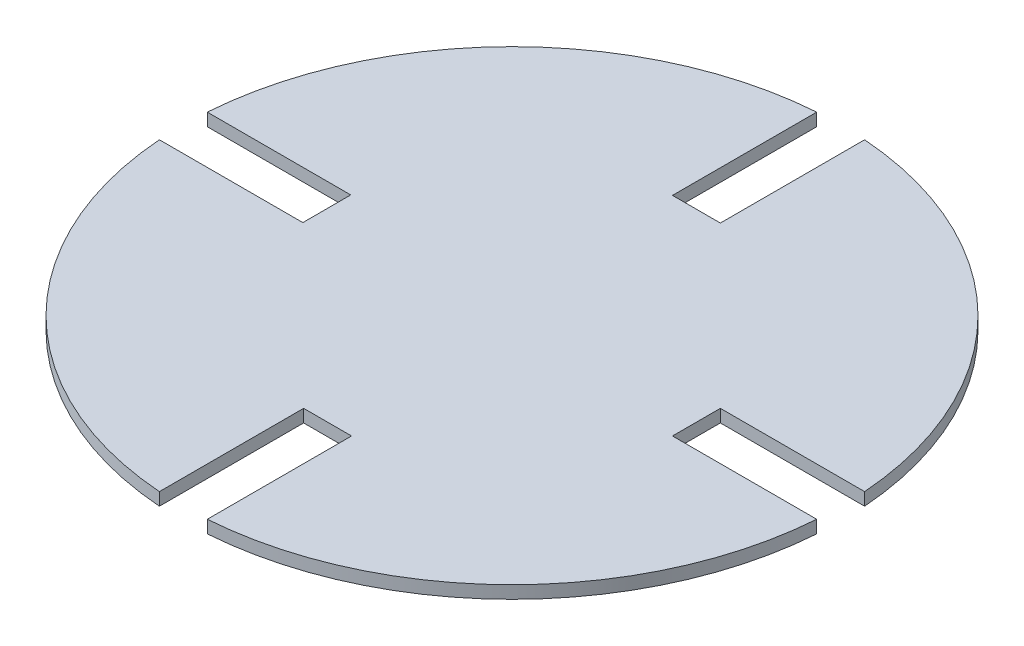
ISO-10303-21;
HEADER;
FILE_DESCRIPTION(('STEP AP214'),'2;1');
FILE_NAME('part.step','',(''),(''),'','','');
FILE_SCHEMA(('AUTOMOTIVE_DESIGN { 1 0 10303 214 1 1 1 1 }'));
ENDSEC;
DATA;
#1=APPLICATION_CONTEXT('core data for automotive mechanical design processes');
#2=APPLICATION_PROTOCOL_DEFINITION('international standard','automotive_design',2000,#1);
#3=PRODUCT_CONTEXT('',#1,'mechanical');
#4=PRODUCT('Part','Part','',(#3));
#5=PRODUCT_RELATED_PRODUCT_CATEGORY('part','',(#4));
#6=PRODUCT_DEFINITION_FORMATION('','',#4);
#7=PRODUCT_DEFINITION_CONTEXT('part definition',#1,'design');
#8=PRODUCT_DEFINITION('design','',#6,#7);
#9=PRODUCT_DEFINITION_SHAPE('','',#8);
#10=(LENGTH_UNIT() NAMED_UNIT(*) SI_UNIT(.MILLI.,.METRE.));
#11=(NAMED_UNIT(*) PLANE_ANGLE_UNIT() SI_UNIT($,.RADIAN.));
#12=(NAMED_UNIT(*) SI_UNIT($,.STERADIAN.) SOLID_ANGLE_UNIT());
#13=UNCERTAINTY_MEASURE_WITH_UNIT(LENGTH_MEASURE(1.E-05),#10,'distance_accuracy_value','');
#14=(GEOMETRIC_REPRESENTATION_CONTEXT(3) GLOBAL_UNCERTAINTY_ASSIGNED_CONTEXT((#13)) GLOBAL_UNIT_ASSIGNED_CONTEXT((#10,
#11,#12)) REPRESENTATION_CONTEXT('',''));
#15=CARTESIAN_POINT('',(0.,0.,0.));
#16=DIRECTION('',(0.,0.,1.));
#17=DIRECTION('',(1.,0.,0.));
#18=AXIS2_PLACEMENT_3D('',#15,#16,#17);
#19=CARTESIAN_POINT('',(0.,3.175,0.));
#20=DIRECTION('',(0.,-1.,0.));
#21=DIRECTION('',(0.,0.,-1.));
#22=AXIS2_PLACEMENT_3D('',#19,#20,#21);
#23=CYLINDRICAL_SURFACE('',#22,82.55);
#24=CARTESIAN_POINT('',(0.,3.175,0.));
#25=DIRECTION('',(0.,1.,0.));
#26=DIRECTION('',(0.,0.,1.));
#27=AXIS2_PLACEMENT_3D('',#24,#25,#26);
#28=CIRCLE('',#27,82.55);
#29=CARTESIAN_POINT('',(82.3316615379527,3.175,-6.0000007));
#30=VERTEX_POINT('',#29);
#31=CARTESIAN_POINT('',(6.0000007,3.175,-82.3316615379527));
#32=VERTEX_POINT('',#31);
#33=EDGE_CURVE('E277',#30,#32,#28,.T.);
#34=ORIENTED_EDGE('',*,*,#33,.F.);
#35=DIRECTION('',(0.,-1.,0.));
#36=VECTOR('',#35,1.);
#37=CARTESIAN_POINT('',(82.3316615379527,3.175,-6.0000007));
#38=LINE('',#37,#36);
#39=CARTESIAN_POINT('',(82.3316615379527,0.,-6.0000007));
#40=VERTEX_POINT('',#39);
#41=EDGE_CURVE('E222',#30,#40,#38,.T.);
#42=ORIENTED_EDGE('',*,*,#41,.T.);
#43=CARTESIAN_POINT('',(0.,0.,0.));
#44=DIRECTION('',(0.,1.,0.));
#45=DIRECTION('',(0.,0.,1.));
#46=AXIS2_PLACEMENT_3D('',#43,#44,#45);
#47=CIRCLE('',#46,82.55);
#48=CARTESIAN_POINT('',(6.0000007,0.,-82.3316615379527));
#49=VERTEX_POINT('',#48);
#50=EDGE_CURVE('E288',#40,#49,#47,.T.);
#51=ORIENTED_EDGE('',*,*,#50,.T.);
#52=DIRECTION('',(0.,-1.,0.));
#53=VECTOR('',#52,1.);
#54=CARTESIAN_POINT('',(6.0000007,3.175,-82.3316615379527));
#55=LINE('',#54,#53);
#56=EDGE_CURVE('E215',#49,#32,#55,.F.);
#57=ORIENTED_EDGE('',*,*,#56,.T.);
#58=EDGE_LOOP('',(#34,#42,#51,#57));
#59=FACE_BOUND('',#58,.T.);
#60=ADVANCED_FACE('F33',(#59),#23,.T.);
#61=CARTESIAN_POINT('',(-6.0000007,3.175,-82.3316615379527));
#62=VERTEX_POINT('',#61);
#63=CARTESIAN_POINT('',(-82.3316615379527,3.175,-6.0000007));
#64=VERTEX_POINT('',#63);
#65=EDGE_CURVE('E256',#62,#64,#28,.T.);
#66=ORIENTED_EDGE('',*,*,#65,.F.);
#67=DIRECTION('',(0.,-1.,0.));
#68=VECTOR('',#67,1.);
#69=CARTESIAN_POINT('',(-6.0000007,3.175,-82.3316615379527));
#70=LINE('',#69,#68);
#71=CARTESIAN_POINT('',(-6.0000007,0.,-82.3316615379527));
#72=VERTEX_POINT('',#71);
#73=EDGE_CURVE('E218',#62,#72,#70,.T.);
#74=ORIENTED_EDGE('',*,*,#73,.T.);
#75=CARTESIAN_POINT('',(-82.3316615379527,0.,-6.0000007));
#76=VERTEX_POINT('',#75);
#77=EDGE_CURVE('E250',#72,#76,#47,.T.);
#78=ORIENTED_EDGE('',*,*,#77,.T.);
#79=DIRECTION('',(0.,-1.,0.));
#80=VECTOR('',#79,1.);
#81=CARTESIAN_POINT('',(-82.3316615379527,3.175,-6.0000007));
#82=LINE('',#81,#80);
#83=EDGE_CURVE('E243',#76,#64,#82,.F.);
#84=ORIENTED_EDGE('',*,*,#83,.T.);
#85=EDGE_LOOP('',(#66,#74,#78,#84));
#86=FACE_BOUND('',#85,.T.);
#87=ADVANCED_FACE('F273',(#86),#23,.T.);
#88=CARTESIAN_POINT('',(-82.3316615379527,0.,6.0000007));
#89=VERTEX_POINT('',#88);
#90=CARTESIAN_POINT('',(-6.00000069999999,0.,82.3316615379527));
#91=VERTEX_POINT('',#90);
#92=EDGE_CURVE('E257',#89,#91,#47,.T.);
#93=ORIENTED_EDGE('',*,*,#92,.T.);
#94=DIRECTION('',(0.,-1.,0.));
#95=VECTOR('',#94,1.);
#96=CARTESIAN_POINT('',(-6.00000069999999,3.175,82.3316615379527));
#97=LINE('',#96,#95);
#98=CARTESIAN_POINT('',(-6.00000069999999,3.175,82.3316615379527));
#99=VERTEX_POINT('',#98);
#100=EDGE_CURVE('E212',#91,#99,#97,.F.);
#101=ORIENTED_EDGE('',*,*,#100,.T.);
#102=CARTESIAN_POINT('',(-82.3316615379527,3.175,6.0000007));
#103=VERTEX_POINT('',#102);
#104=EDGE_CURVE('E251',#103,#99,#28,.T.);
#105=ORIENTED_EDGE('',*,*,#104,.F.);
#106=DIRECTION('',(0.,-1.,0.));
#107=VECTOR('',#106,1.);
#108=CARTESIAN_POINT('',(-82.3316615379527,3.175,6.0000007));
#109=LINE('',#108,#107);
#110=EDGE_CURVE('E247',#103,#89,#109,.T.);
#111=ORIENTED_EDGE('',*,*,#110,.T.);
#112=EDGE_LOOP('',(#93,#101,#105,#111));
#113=FACE_BOUND('',#112,.T.);
#114=ADVANCED_FACE('F308',(#113),#23,.T.);
#115=CARTESIAN_POINT('',(6.00000070000001,0.,82.3316615379527));
#116=VERTEX_POINT('',#115);
#117=CARTESIAN_POINT('',(82.3316615379527,0.,6.0000007));
#118=VERTEX_POINT('',#117);
#119=EDGE_CURVE('E260',#116,#118,#47,.T.);
#120=ORIENTED_EDGE('',*,*,#119,.T.);
#121=DIRECTION('',(0.,-1.,0.));
#122=VECTOR('',#121,1.);
#123=CARTESIAN_POINT('',(82.3316615379527,3.175,6.0000007));
#124=LINE('',#123,#122);
#125=CARTESIAN_POINT('',(82.3316615379527,3.175,6.0000007));
#126=VERTEX_POINT('',#125);
#127=EDGE_CURVE('E163',#118,#126,#124,.F.);
#128=ORIENTED_EDGE('',*,*,#127,.T.);
#129=CARTESIAN_POINT('',(6.00000070000001,3.175,82.3316615379527));
#130=VERTEX_POINT('',#129);
#131=EDGE_CURVE('E255',#130,#126,#28,.T.);
#132=ORIENTED_EDGE('',*,*,#131,.F.);
#133=DIRECTION('',(0.,-1.,0.));
#134=VECTOR('',#133,1.);
#135=CARTESIAN_POINT('',(6.00000070000001,3.175,82.3316615379527));
#136=LINE('',#135,#134);
#137=EDGE_CURVE('E178',#130,#116,#136,.T.);
#138=ORIENTED_EDGE('',*,*,#137,.T.);
#139=EDGE_LOOP('',(#120,#128,#132,#138));
#140=FACE_BOUND('',#139,.T.);
#141=ADVANCED_FACE('F35',(#140),#23,.T.);
#142=CARTESIAN_POINT('',(0.,3.175,0.));
#143=DIRECTION('',(0.,1.,0.));
#144=DIRECTION('',(0.,0.,1.));
#145=AXIS2_PLACEMENT_3D('',#142,#143,#144);
#146=PLANE('',#145);
#147=DIRECTION('',(-1.,0.,0.));
#148=VECTOR('',#147,1.);
#149=CARTESIAN_POINT('',(106.19994,3.175,-6.0000007));
#150=LINE('',#149,#148);
#151=CARTESIAN_POINT('',(46.20006,3.175,-6.0000007));
#152=VERTEX_POINT('',#151);
#153=EDGE_CURVE('E170',#30,#152,#150,.T.);
#154=ORIENTED_EDGE('',*,*,#153,.F.);
#155=ORIENTED_EDGE('',*,*,#33,.T.);
#156=DIRECTION('',(0.,0.,-1.));
#157=VECTOR('',#156,1.);
#158=CARTESIAN_POINT('',(6.0000007,3.175,-46.20006));
#159=LINE('',#158,#157);
#160=CARTESIAN_POINT('',(6.0000007,3.175,-46.20006));
#161=VERTEX_POINT('',#160);
#162=EDGE_CURVE('E183',#161,#32,#159,.T.);
#163=ORIENTED_EDGE('',*,*,#162,.F.);
#164=DIRECTION('',(1.,0.,0.));
#165=VECTOR('',#164,1.);
#166=CARTESIAN_POINT('',(6.0000007,3.175,-46.20006));
#167=LINE('',#166,#165);
#168=CARTESIAN_POINT('',(-6.0000007,3.175,-46.20006));
#169=VERTEX_POINT('',#168);
#170=EDGE_CURVE('E188',#169,#161,#167,.T.);
#171=ORIENTED_EDGE('',*,*,#170,.F.);
#172=DIRECTION('',(0.,0.,1.));
#173=VECTOR('',#172,1.);
#174=CARTESIAN_POINT('',(-6.0000007,3.175,-46.20006));
#175=LINE('',#174,#173);
#176=EDGE_CURVE('E186',#62,#169,#175,.T.);
#177=ORIENTED_EDGE('',*,*,#176,.F.);
#178=ORIENTED_EDGE('',*,*,#65,.T.);
#179=DIRECTION('',(-1.,0.,0.));
#180=VECTOR('',#179,1.);
#181=CARTESIAN_POINT('',(-105.99928,3.175,-6.0000007));
#182=LINE('',#181,#180);
#183=CARTESIAN_POINT('',(-46.40072,3.175,-6.0000007));
#184=VERTEX_POINT('',#183);
#185=EDGE_CURVE('E236',#184,#64,#182,.T.);
#186=ORIENTED_EDGE('',*,*,#185,.F.);
#187=DIRECTION('',(0.,0.,-1.));
#188=VECTOR('',#187,1.);
#189=CARTESIAN_POINT('',(-46.40072,3.175,6.0000007));
#190=LINE('',#189,#188);
#191=CARTESIAN_POINT('',(-46.40072,3.175,6.0000007));
#192=VERTEX_POINT('',#191);
#193=EDGE_CURVE('E225',#192,#184,#190,.T.);
#194=ORIENTED_EDGE('',*,*,#193,.F.);
#195=DIRECTION('',(1.,0.,0.));
#196=VECTOR('',#195,1.);
#197=CARTESIAN_POINT('',(-105.99928,3.175,6.0000007));
#198=LINE('',#197,#196);
#199=EDGE_CURVE('E230',#103,#192,#198,.T.);
#200=ORIENTED_EDGE('',*,*,#199,.F.);
#201=ORIENTED_EDGE('',*,*,#104,.T.);
#202=DIRECTION('',(0.,0.,1.));
#203=VECTOR('',#202,1.);
#204=CARTESIAN_POINT('',(-6.00000069999999,3.175,106.19994));
#205=LINE('',#204,#203);
#206=CARTESIAN_POINT('',(-6.00000069999999,3.175,46.20006));
#207=VERTEX_POINT('',#206);
#208=EDGE_CURVE('E202',#207,#99,#205,.T.);
#209=ORIENTED_EDGE('',*,*,#208,.F.);
#210=DIRECTION('',(-1.,0.,0.));
#211=VECTOR('',#210,1.);
#212=CARTESIAN_POINT('',(6.00000070000001,3.175,46.20006));
#213=LINE('',#212,#211);
#214=CARTESIAN_POINT('',(6.00000070000001,3.175,46.20006));
#215=VERTEX_POINT('',#214);
#216=EDGE_CURVE('E199',#215,#207,#213,.T.);
#217=ORIENTED_EDGE('',*,*,#216,.F.);
#218=DIRECTION('',(0.,0.,-1.));
#219=VECTOR('',#218,1.);
#220=CARTESIAN_POINT('',(6.00000070000001,3.175,106.19994));
#221=LINE('',#220,#219);
#222=EDGE_CURVE('E204',#130,#215,#221,.T.);
#223=ORIENTED_EDGE('',*,*,#222,.F.);
#224=ORIENTED_EDGE('',*,*,#131,.T.);
#225=DIRECTION('',(1.,0.,0.));
#226=VECTOR('',#225,1.);
#227=CARTESIAN_POINT('',(106.19994,3.175,6.0000007));
#228=LINE('',#227,#226);
#229=CARTESIAN_POINT('',(46.20006,3.175,6.0000007));
#230=VERTEX_POINT('',#229);
#231=EDGE_CURVE('E172',#230,#126,#228,.T.);
#232=ORIENTED_EDGE('',*,*,#231,.F.);
#233=DIRECTION('',(0.,0.,1.));
#234=VECTOR('',#233,1.);
#235=CARTESIAN_POINT('',(46.20006,3.175,6.0000007));
#236=LINE('',#235,#234);
#237=EDGE_CURVE('E154',#152,#230,#236,.T.);
#238=ORIENTED_EDGE('',*,*,#237,.F.);
#239=EDGE_LOOP('',(#154,#155,#163,#171,#177,#178,#186,#194,#200,#201,#209,#217,#223,#224,#232,#238));
#240=FACE_BOUND('',#239,.T.);
#241=ADVANCED_FACE('F285',(#240),#146,.T.);
#242=CARTESIAN_POINT('',(0.,0.,0.));
#243=DIRECTION('',(0.,1.,0.));
#244=DIRECTION('',(0.,0.,1.));
#245=AXIS2_PLACEMENT_3D('',#242,#243,#244);
#246=PLANE('',#245);
#247=ORIENTED_EDGE('',*,*,#50,.F.);
#248=DIRECTION('',(-1.,0.,0.));
#249=VECTOR('',#248,1.);
#250=CARTESIAN_POINT('',(0.,0.,-6.0000007));
#251=LINE('',#250,#249);
#252=CARTESIAN_POINT('',(46.20006,0.,-6.0000007));
#253=VERTEX_POINT('',#252);
#254=EDGE_CURVE('E11',#40,#253,#251,.T.);
#255=ORIENTED_EDGE('',*,*,#254,.T.);
#256=DIRECTION('',(0.,0.,1.));
#257=VECTOR('',#256,1.);
#258=CARTESIAN_POINT('',(46.20006,0.,6.0000007));
#259=LINE('',#258,#257);
#260=CARTESIAN_POINT('',(46.20006,0.,6.0000007));
#261=VERTEX_POINT('',#260);
#262=EDGE_CURVE('E152',#253,#261,#259,.T.);
#263=ORIENTED_EDGE('',*,*,#262,.T.);
#264=DIRECTION('',(1.,0.,0.));
#265=VECTOR('',#264,1.);
#266=CARTESIAN_POINT('',(106.19994,0.,6.0000007));
#267=LINE('',#266,#265);
#268=EDGE_CURVE('E158',#261,#118,#267,.T.);
#269=ORIENTED_EDGE('',*,*,#268,.T.);
#270=ORIENTED_EDGE('',*,*,#119,.F.);
#271=DIRECTION('',(0.,0.,-1.));
#272=VECTOR('',#271,1.);
#273=CARTESIAN_POINT('',(6.00000070000001,0.,0.));
#274=LINE('',#273,#272);
#275=CARTESIAN_POINT('',(6.00000070000001,0.,46.20006));
#276=VERTEX_POINT('',#275);
#277=EDGE_CURVE('E263',#116,#276,#274,.T.);
#278=ORIENTED_EDGE('',*,*,#277,.T.);
#279=DIRECTION('',(-1.,0.,0.));
#280=VECTOR('',#279,1.);
#281=CARTESIAN_POINT('',(6.00000070000001,0.,46.20006));
#282=LINE('',#281,#280);
#283=CARTESIAN_POINT('',(-6.00000069999999,0.,46.20006));
#284=VERTEX_POINT('',#283);
#285=EDGE_CURVE('E56',#276,#284,#282,.T.);
#286=ORIENTED_EDGE('',*,*,#285,.T.);
#287=DIRECTION('',(0.,0.,1.));
#288=VECTOR('',#287,1.);
#289=CARTESIAN_POINT('',(-6.00000069999999,0.,106.19994));
#290=LINE('',#289,#288);
#291=EDGE_CURVE('E196',#284,#91,#290,.T.);
#292=ORIENTED_EDGE('',*,*,#291,.T.);
#293=ORIENTED_EDGE('',*,*,#92,.F.);
#294=DIRECTION('',(1.,0.,0.));
#295=VECTOR('',#294,1.);
#296=CARTESIAN_POINT('',(0.,0.,6.0000007));
#297=LINE('',#296,#295);
#298=CARTESIAN_POINT('',(-46.40072,0.,6.0000007));
#299=VERTEX_POINT('',#298);
#300=EDGE_CURVE('E254',#89,#299,#297,.T.);
#301=ORIENTED_EDGE('',*,*,#300,.T.);
#302=DIRECTION('',(0.,0.,-1.));
#303=VECTOR('',#302,1.);
#304=CARTESIAN_POINT('',(-46.40072,0.,6.0000007));
#305=LINE('',#304,#303);
#306=CARTESIAN_POINT('',(-46.40072,0.,-6.0000007));
#307=VERTEX_POINT('',#306);
#308=EDGE_CURVE('E226',#299,#307,#305,.T.);
#309=ORIENTED_EDGE('',*,*,#308,.T.);
#310=DIRECTION('',(-1.,0.,0.));
#311=VECTOR('',#310,1.);
#312=CARTESIAN_POINT('',(-105.99928,0.,-6.0000007));
#313=LINE('',#312,#311);
#314=EDGE_CURVE('E229',#307,#76,#313,.T.);
#315=ORIENTED_EDGE('',*,*,#314,.T.);
#316=ORIENTED_EDGE('',*,*,#77,.F.);
#317=DIRECTION('',(0.,0.,1.));
#318=VECTOR('',#317,1.);
#319=CARTESIAN_POINT('',(-6.0000007,0.,0.));
#320=LINE('',#319,#318);
#321=CARTESIAN_POINT('',(-6.0000007,0.,-46.20006));
#322=VERTEX_POINT('',#321);
#323=EDGE_CURVE('E41',#72,#322,#320,.T.);
#324=ORIENTED_EDGE('',*,*,#323,.T.);
#325=DIRECTION('',(1.,0.,0.));
#326=VECTOR('',#325,1.);
#327=CARTESIAN_POINT('',(6.0000007,0.,-46.20006));
#328=LINE('',#327,#326);
#329=CARTESIAN_POINT('',(6.0000007,0.,-46.20006));
#330=VERTEX_POINT('',#329);
#331=EDGE_CURVE('E180',#322,#330,#328,.T.);
#332=ORIENTED_EDGE('',*,*,#331,.T.);
#333=DIRECTION('',(0.,0.,-1.));
#334=VECTOR('',#333,1.);
#335=CARTESIAN_POINT('',(6.0000007,0.,-46.20006));
#336=LINE('',#335,#334);
#337=EDGE_CURVE('E48',#330,#49,#336,.T.);
#338=ORIENTED_EDGE('',*,*,#337,.T.);
#339=EDGE_LOOP('',(#247,#255,#263,#269,#270,#278,#286,#292,#293,#301,#309,#315,#316,#324,#332,#338));
#340=FACE_BOUND('',#339,.T.);
#341=ADVANCED_FACE('F169',(#340),#246,.F.);
#342=CARTESIAN_POINT('',(-105.99928,0.,6.0000007));
#343=DIRECTION('',(0.,0.,1.));
#344=DIRECTION('',(1.,0.,0.));
#345=AXIS2_PLACEMENT_3D('',#342,#343,#344);
#346=PLANE('',#345);
#347=ORIENTED_EDGE('',*,*,#199,.T.);
#348=DIRECTION('',(0.,1.,0.));
#349=VECTOR('',#348,1.);
#350=CARTESIAN_POINT('',(-46.40072,0.,6.0000007));
#351=LINE('',#350,#349);
#352=EDGE_CURVE('E240',#299,#192,#351,.T.);
#353=ORIENTED_EDGE('',*,*,#352,.F.);
#354=ORIENTED_EDGE('',*,*,#300,.F.);
#355=ORIENTED_EDGE('',*,*,#110,.F.);
#356=EDGE_LOOP('',(#347,#353,#354,#355));
#357=FACE_BOUND('',#356,.T.);
#358=ADVANCED_FACE('F327',(#357),#346,.F.);
#359=CARTESIAN_POINT('',(-105.99928,0.,-6.0000007));
#360=DIRECTION('',(0.,0.,-1.));
#361=DIRECTION('',(-1.,0.,0.));
#362=AXIS2_PLACEMENT_3D('',#359,#360,#361);
#363=PLANE('',#362);
#364=ORIENTED_EDGE('',*,*,#314,.F.);
#365=DIRECTION('',(0.,1.,0.));
#366=VECTOR('',#365,1.);
#367=CARTESIAN_POINT('',(-46.40072,0.,-6.0000007));
#368=LINE('',#367,#366);
#369=EDGE_CURVE('E233',#307,#184,#368,.T.);
#370=ORIENTED_EDGE('',*,*,#369,.T.);
#371=ORIENTED_EDGE('',*,*,#185,.T.);
#372=ORIENTED_EDGE('',*,*,#83,.F.);
#373=EDGE_LOOP('',(#364,#370,#371,#372));
#374=FACE_BOUND('',#373,.T.);
#375=ADVANCED_FACE('F333',(#374),#363,.F.);
#376=CARTESIAN_POINT('',(-46.40072,0.,6.0000007));
#377=DIRECTION('',(1.,0.,0.));
#378=DIRECTION('',(0.,0.,-1.));
#379=AXIS2_PLACEMENT_3D('',#376,#377,#378);
#380=PLANE('',#379);
#381=ORIENTED_EDGE('',*,*,#193,.T.);
#382=ORIENTED_EDGE('',*,*,#369,.F.);
#383=ORIENTED_EDGE('',*,*,#308,.F.);
#384=ORIENTED_EDGE('',*,*,#352,.T.);
#385=EDGE_LOOP('',(#381,#382,#383,#384));
#386=FACE_BOUND('',#385,.T.);
#387=ADVANCED_FACE('F330',(#386),#380,.F.);
#388=CARTESIAN_POINT('',(-6.00000069999999,0.,106.19994));
#389=DIRECTION('',(-1.,0.,0.));
#390=DIRECTION('',(0.,0.,1.));
#391=AXIS2_PLACEMENT_3D('',#388,#389,#390);
#392=PLANE('',#391);
#393=ORIENTED_EDGE('',*,*,#291,.F.);
#394=DIRECTION('',(0.,1.,0.));
#395=VECTOR('',#394,1.);
#396=CARTESIAN_POINT('',(-6.00000069999999,0.,46.20006));
#397=LINE('',#396,#395);
#398=EDGE_CURVE('E189',#284,#207,#397,.T.);
#399=ORIENTED_EDGE('',*,*,#398,.T.);
#400=ORIENTED_EDGE('',*,*,#208,.T.);
#401=ORIENTED_EDGE('',*,*,#100,.F.);
#402=EDGE_LOOP('',(#393,#399,#400,#401));
#403=FACE_BOUND('',#402,.T.);
#404=ADVANCED_FACE('F322',(#403),#392,.F.);
#405=CARTESIAN_POINT('',(6.00000070000001,0.,106.19994));
#406=DIRECTION('',(1.,0.,0.));
#407=DIRECTION('',(0.,0.,-1.));
#408=AXIS2_PLACEMENT_3D('',#405,#406,#407);
#409=PLANE('',#408);
#410=ORIENTED_EDGE('',*,*,#222,.T.);
#411=DIRECTION('',(0.,1.,0.));
#412=VECTOR('',#411,1.);
#413=CARTESIAN_POINT('',(6.00000070000001,0.,46.20006));
#414=LINE('',#413,#412);
#415=EDGE_CURVE('E201',#276,#215,#414,.T.);
#416=ORIENTED_EDGE('',*,*,#415,.F.);
#417=ORIENTED_EDGE('',*,*,#277,.F.);
#418=ORIENTED_EDGE('',*,*,#137,.F.);
#419=EDGE_LOOP('',(#410,#416,#417,#418));
#420=FACE_BOUND('',#419,.T.);
#421=ADVANCED_FACE('F372',(#420),#409,.F.);
#422=CARTESIAN_POINT('',(6.00000070000001,0.,46.20006));
#423=DIRECTION('',(0.,0.,-1.));
#424=DIRECTION('',(-1.,0.,0.));
#425=AXIS2_PLACEMENT_3D('',#422,#423,#424);
#426=PLANE('',#425);
#427=ORIENTED_EDGE('',*,*,#216,.T.);
#428=ORIENTED_EDGE('',*,*,#398,.F.);
#429=ORIENTED_EDGE('',*,*,#285,.F.);
#430=ORIENTED_EDGE('',*,*,#415,.T.);
#431=EDGE_LOOP('',(#427,#428,#429,#430));
#432=FACE_BOUND('',#431,.T.);
#433=ADVANCED_FACE('F380',(#432),#426,.F.);
#434=CARTESIAN_POINT('',(-6.0000007,0.,-46.20006));
#435=DIRECTION('',(-1.,0.,0.));
#436=DIRECTION('',(0.,0.,1.));
#437=AXIS2_PLACEMENT_3D('',#434,#435,#436);
#438=PLANE('',#437);
#439=ORIENTED_EDGE('',*,*,#176,.T.);
#440=DIRECTION('',(0.,1.,0.));
#441=VECTOR('',#440,1.);
#442=CARTESIAN_POINT('',(-6.0000007,0.,-46.20006));
#443=LINE('',#442,#441);
#444=EDGE_CURVE('E185',#322,#169,#443,.T.);
#445=ORIENTED_EDGE('',*,*,#444,.F.);
#446=ORIENTED_EDGE('',*,*,#323,.F.);
#447=ORIENTED_EDGE('',*,*,#73,.F.);
#448=EDGE_LOOP('',(#439,#445,#446,#447));
#449=FACE_BOUND('',#448,.T.);
#450=ADVANCED_FACE('F269',(#449),#438,.F.);
#451=CARTESIAN_POINT('',(6.0000007,0.,-46.20006));
#452=DIRECTION('',(1.,0.,0.));
#453=DIRECTION('',(0.,0.,-1.));
#454=AXIS2_PLACEMENT_3D('',#451,#452,#453);
#455=PLANE('',#454);
#456=ORIENTED_EDGE('',*,*,#337,.F.);
#457=DIRECTION('',(0.,1.,0.));
#458=VECTOR('',#457,1.);
#459=CARTESIAN_POINT('',(6.0000007,0.,-46.20006));
#460=LINE('',#459,#458);
#461=EDGE_CURVE('E176',#330,#161,#460,.T.);
#462=ORIENTED_EDGE('',*,*,#461,.T.);
#463=ORIENTED_EDGE('',*,*,#162,.T.);
#464=ORIENTED_EDGE('',*,*,#56,.F.);
#465=EDGE_LOOP('',(#456,#462,#463,#464));
#466=FACE_BOUND('',#465,.T.);
#467=ADVANCED_FACE('F301',(#466),#455,.F.);
#468=CARTESIAN_POINT('',(6.0000007,0.,-46.20006));
#469=DIRECTION('',(0.,0.,1.));
#470=DIRECTION('',(1.,0.,0.));
#471=AXIS2_PLACEMENT_3D('',#468,#469,#470);
#472=PLANE('',#471);
#473=ORIENTED_EDGE('',*,*,#170,.T.);
#474=ORIENTED_EDGE('',*,*,#461,.F.);
#475=ORIENTED_EDGE('',*,*,#331,.F.);
#476=ORIENTED_EDGE('',*,*,#444,.T.);
#477=EDGE_LOOP('',(#473,#474,#475,#476));
#478=FACE_BOUND('',#477,.T.);
#479=ADVANCED_FACE('F294',(#478),#472,.F.);
#480=CARTESIAN_POINT('',(106.19994,0.,-6.0000007));
#481=DIRECTION('',(0.,0.,-1.));
#482=DIRECTION('',(-1.,0.,0.));
#483=AXIS2_PLACEMENT_3D('',#480,#481,#482);
#484=PLANE('',#483);
#485=ORIENTED_EDGE('',*,*,#153,.T.);
#486=DIRECTION('',(0.,1.,0.));
#487=VECTOR('',#486,1.);
#488=CARTESIAN_POINT('',(46.20006,0.,-6.0000007));
#489=LINE('',#488,#487);
#490=EDGE_CURVE('E157',#253,#152,#489,.T.);
#491=ORIENTED_EDGE('',*,*,#490,.F.);
#492=ORIENTED_EDGE('',*,*,#254,.F.);
#493=ORIENTED_EDGE('',*,*,#41,.F.);
#494=EDGE_LOOP('',(#485,#491,#492,#493));
#495=FACE_BOUND('',#494,.T.);
#496=ADVANCED_FACE('F292',(#495),#484,.F.);
#497=CARTESIAN_POINT('',(106.19994,0.,6.0000007));
#498=DIRECTION('',(0.,0.,1.));
#499=DIRECTION('',(1.,0.,0.));
#500=AXIS2_PLACEMENT_3D('',#497,#498,#499);
#501=PLANE('',#500);
#502=ORIENTED_EDGE('',*,*,#268,.F.);
#503=DIRECTION('',(0.,1.,0.));
#504=VECTOR('',#503,1.);
#505=CARTESIAN_POINT('',(46.20006,0.,6.0000007));
#506=LINE('',#505,#504);
#507=EDGE_CURVE('E147',#261,#230,#506,.T.);
#508=ORIENTED_EDGE('',*,*,#507,.T.);
#509=ORIENTED_EDGE('',*,*,#231,.T.);
#510=ORIENTED_EDGE('',*,*,#127,.F.);
#511=EDGE_LOOP('',(#502,#508,#509,#510));
#512=FACE_BOUND('',#511,.T.);
#513=ADVANCED_FACE('F161',(#512),#501,.F.);
#514=CARTESIAN_POINT('',(46.20006,0.,6.0000007));
#515=DIRECTION('',(-1.,0.,0.));
#516=DIRECTION('',(0.,0.,1.));
#517=AXIS2_PLACEMENT_3D('',#514,#515,#516);
#518=PLANE('',#517);
#519=ORIENTED_EDGE('',*,*,#237,.T.);
#520=ORIENTED_EDGE('',*,*,#507,.F.);
#521=ORIENTED_EDGE('',*,*,#262,.F.);
#522=ORIENTED_EDGE('',*,*,#490,.T.);
#523=EDGE_LOOP('',(#519,#520,#521,#522));
#524=FACE_BOUND('',#523,.T.);
#525=ADVANCED_FACE('F149',(#524),#518,.F.);
#526=CLOSED_SHELL('',(#60,#87,#114,#141,#241,#341,#358,#375,#387,#404,#421,#433,#450,#467,#479,
#496,#513,#525));
#527=MANIFOLD_SOLID_BREP('B2',#526);
#528=ADVANCED_BREP_SHAPE_REPRESENTATION('',(#18,#527),#14);
#529=SHAPE_DEFINITION_REPRESENTATION(#9,#528);
ENDSEC;
END-ISO-10303-21;
